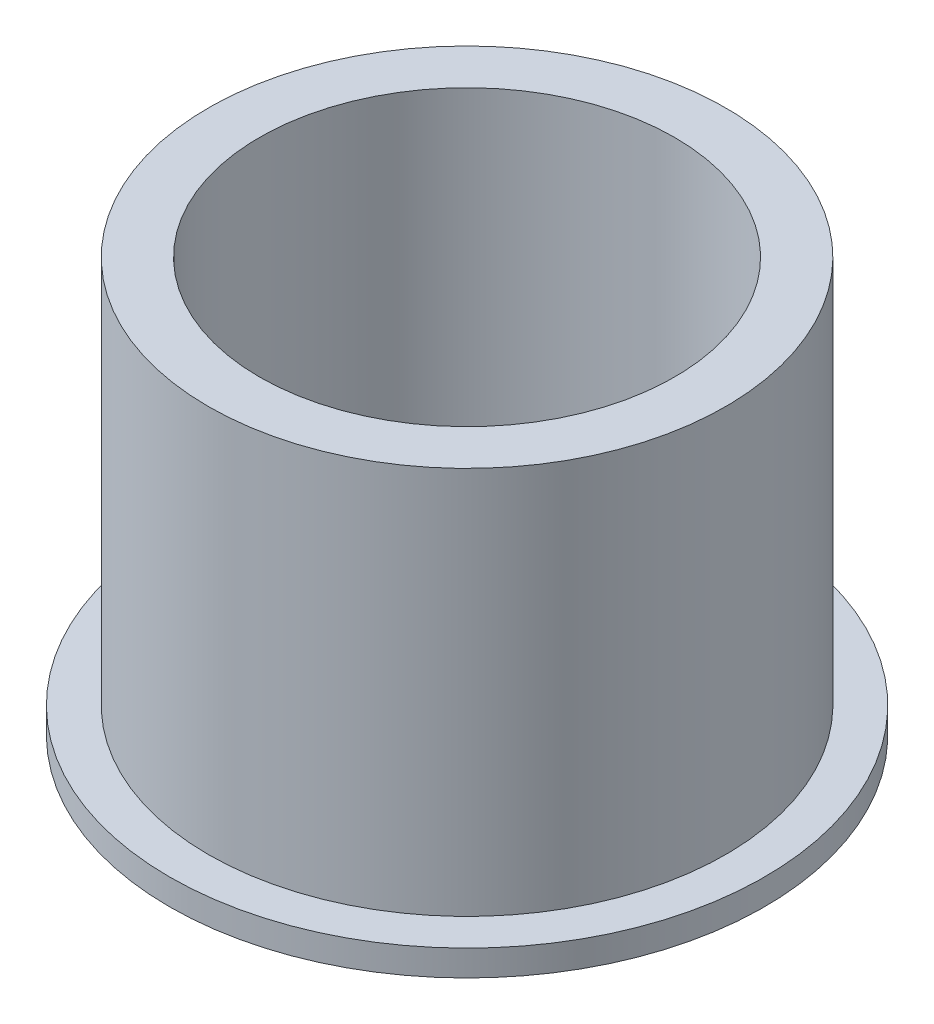
ISO-10303-21;
HEADER;
FILE_DESCRIPTION(('STEP AP214'),'2;1');
FILE_NAME('part.step','',(''),(''),'','','');
FILE_SCHEMA(('AUTOMOTIVE_DESIGN { 1 0 10303 214 1 1 1 1 }'));
ENDSEC;
DATA;
#1=APPLICATION_CONTEXT('core data for automotive mechanical design processes');
#2=APPLICATION_PROTOCOL_DEFINITION('international standard','automotive_design',2000,#1);
#3=PRODUCT_CONTEXT('',#1,'mechanical');
#4=PRODUCT('Part','Part','',(#3));
#5=PRODUCT_RELATED_PRODUCT_CATEGORY('part','',(#4));
#6=PRODUCT_DEFINITION_FORMATION('','',#4);
#7=PRODUCT_DEFINITION_CONTEXT('part definition',#1,'design');
#8=PRODUCT_DEFINITION('design','',#6,#7);
#9=PRODUCT_DEFINITION_SHAPE('','',#8);
#10=(LENGTH_UNIT() NAMED_UNIT(*) SI_UNIT(.MILLI.,.METRE.));
#11=(NAMED_UNIT(*) PLANE_ANGLE_UNIT() SI_UNIT($,.RADIAN.));
#12=(NAMED_UNIT(*) SI_UNIT($,.STERADIAN.) SOLID_ANGLE_UNIT());
#13=UNCERTAINTY_MEASURE_WITH_UNIT(LENGTH_MEASURE(1.E-05),#10,'distance_accuracy_value','');
#14=(GEOMETRIC_REPRESENTATION_CONTEXT(3) GLOBAL_UNCERTAINTY_ASSIGNED_CONTEXT((#13)) GLOBAL_UNIT_ASSIGNED_CONTEXT((#10,
#11,#12)) REPRESENTATION_CONTEXT('',''));
#15=CARTESIAN_POINT('',(0.,0.,0.));
#16=DIRECTION('',(0.,0.,1.));
#17=DIRECTION('',(1.,0.,0.));
#18=AXIS2_PLACEMENT_3D('',#15,#16,#17);
#19=CARTESIAN_POINT('',(0.,25.4,0.));
#20=DIRECTION('',(0.,1.,0.));
#21=DIRECTION('',(0.,0.,1.));
#22=AXIS2_PLACEMENT_3D('',#19,#20,#21);
#23=PLANE('',#22);
#24=CARTESIAN_POINT('',(0.,25.4,0.));
#25=DIRECTION('',(0.,1.,0.));
#26=DIRECTION('',(0.,0.,1.));
#27=AXIS2_PLACEMENT_3D('',#24,#25,#26);
#28=CIRCLE('',#27,15.875);
#29=CARTESIAN_POINT('',(0.,25.4,15.875));
#30=VERTEX_POINT('',#29);
#31=EDGE_CURVE('E10',#30,#30,#28,.T.);
#32=ORIENTED_EDGE('',*,*,#31,.T.);
#33=EDGE_LOOP('',(#32));
#34=FACE_BOUND('',#33,.T.);
#35=CARTESIAN_POINT('',(0.,25.4,0.));
#36=DIRECTION('',(0.,1.,0.));
#37=DIRECTION('',(0.,0.,1.));
#38=AXIS2_PLACEMENT_3D('',#35,#36,#37);
#39=CIRCLE('',#38,12.7381);
#40=CARTESIAN_POINT('',(0.,25.4,12.7381));
#41=VERTEX_POINT('',#40);
#42=EDGE_CURVE('E39',#41,#41,#39,.T.);
#43=ORIENTED_EDGE('',*,*,#42,.F.);
#44=EDGE_LOOP('',(#43));
#45=FACE_BOUND('',#44,.T.);
#46=ADVANCED_FACE('F32',(#34,#45),#23,.T.);
#47=CARTESIAN_POINT('',(0.,0.,0.));
#48=DIRECTION('',(0.,1.,0.));
#49=DIRECTION('',(0.,0.,1.));
#50=AXIS2_PLACEMENT_3D('',#47,#48,#49);
#51=PLANE('',#50);
#52=CARTESIAN_POINT('',(0.,0.,0.));
#53=DIRECTION('',(0.,1.,0.));
#54=DIRECTION('',(0.,0.,1.));
#55=AXIS2_PLACEMENT_3D('',#52,#53,#54);
#56=CIRCLE('',#55,12.7381);
#57=CARTESIAN_POINT('',(0.,0.,12.7381));
#58=VERTEX_POINT('',#57);
#59=EDGE_CURVE('E43',#58,#58,#56,.T.);
#60=ORIENTED_EDGE('',*,*,#59,.T.);
#61=EDGE_LOOP('',(#60));
#62=FACE_BOUND('',#61,.T.);
#63=CARTESIAN_POINT('',(0.,0.,0.));
#64=DIRECTION('',(0.,1.,0.));
#65=DIRECTION('',(0.,0.,1.));
#66=AXIS2_PLACEMENT_3D('',#63,#64,#65);
#67=CIRCLE('',#66,18.25625);
#68=CARTESIAN_POINT('',(0.,0.,18.25625));
#69=VERTEX_POINT('',#68);
#70=EDGE_CURVE('E50',#69,#69,#67,.T.);
#71=ORIENTED_EDGE('',*,*,#70,.F.);
#72=EDGE_LOOP('',(#71));
#73=FACE_BOUND('',#72,.T.);
#74=ADVANCED_FACE('F75',(#62,#73),#51,.F.);
#75=CARTESIAN_POINT('',(0.,25.4,0.));
#76=DIRECTION('',(0.,-1.,0.));
#77=DIRECTION('',(0.,0.,-1.));
#78=AXIS2_PLACEMENT_3D('',#75,#76,#77);
#79=CYLINDRICAL_SURFACE('',#78,15.875);
#80=CARTESIAN_POINT('',(0.,1.5875,0.));
#81=DIRECTION('',(0.,1.,0.));
#82=DIRECTION('',(0.,0.,1.));
#83=AXIS2_PLACEMENT_3D('',#80,#81,#82);
#84=CIRCLE('',#83,15.875);
#85=CARTESIAN_POINT('',(0.,1.5875,15.875));
#86=VERTEX_POINT('',#85);
#87=EDGE_CURVE('E53',#86,#86,#84,.T.);
#88=ORIENTED_EDGE('',*,*,#87,.T.);
#89=EDGE_LOOP('',(#88));
#90=FACE_BOUND('',#89,.T.);
#91=ORIENTED_EDGE('',*,*,#31,.F.);
#92=EDGE_LOOP('',(#91));
#93=FACE_BOUND('',#92,.T.);
#94=ADVANCED_FACE('F34',(#90,#93),#79,.T.);
#95=CARTESIAN_POINT('',(0.,25.4,0.));
#96=DIRECTION('',(0.,-1.,0.));
#97=DIRECTION('',(0.,0.,-1.));
#98=AXIS2_PLACEMENT_3D('',#95,#96,#97);
#99=CYLINDRICAL_SURFACE('',#98,12.7381);
#100=ORIENTED_EDGE('',*,*,#42,.T.);
#101=EDGE_LOOP('',(#100));
#102=FACE_BOUND('',#101,.T.);
#103=ORIENTED_EDGE('',*,*,#59,.F.);
#104=EDGE_LOOP('',(#103));
#105=FACE_BOUND('',#104,.T.);
#106=ADVANCED_FACE('F64',(#102,#105),#99,.F.);
#107=CARTESIAN_POINT('',(0.,1.5875,0.));
#108=DIRECTION('',(0.,1.,0.));
#109=DIRECTION('',(0.,0.,1.));
#110=AXIS2_PLACEMENT_3D('',#107,#108,#109);
#111=PLANE('',#110);
#112=CARTESIAN_POINT('',(0.,1.5875,0.));
#113=DIRECTION('',(0.,1.,0.));
#114=DIRECTION('',(0.,0.,1.));
#115=AXIS2_PLACEMENT_3D('',#112,#113,#114);
#116=CIRCLE('',#115,18.25625);
#117=CARTESIAN_POINT('',(0.,1.5875,18.25625));
#118=VERTEX_POINT('',#117);
#119=EDGE_CURVE('E48',#118,#118,#116,.T.);
#120=ORIENTED_EDGE('',*,*,#119,.T.);
#121=EDGE_LOOP('',(#120));
#122=FACE_BOUND('',#121,.T.);
#123=ORIENTED_EDGE('',*,*,#87,.F.);
#124=EDGE_LOOP('',(#123));
#125=FACE_BOUND('',#124,.T.);
#126=ADVANCED_FACE('F61',(#122,#125),#111,.T.);
#127=CARTESIAN_POINT('',(0.,1.5875,0.));
#128=DIRECTION('',(0.,-1.,0.));
#129=DIRECTION('',(0.,0.,-1.));
#130=AXIS2_PLACEMENT_3D('',#127,#128,#129);
#131=CYLINDRICAL_SURFACE('',#130,18.25625);
#132=ORIENTED_EDGE('',*,*,#119,.F.);
#133=EDGE_LOOP('',(#132));
#134=FACE_BOUND('',#133,.T.);
#135=ORIENTED_EDGE('',*,*,#70,.T.);
#136=EDGE_LOOP('',(#135));
#137=FACE_BOUND('',#136,.T.);
#138=ADVANCED_FACE('F63',(#134,#137),#131,.T.);
#139=CLOSED_SHELL('',(#46,#74,#94,#106,#126,#138));
#140=MANIFOLD_SOLID_BREP('B2',#139);
#141=ADVANCED_BREP_SHAPE_REPRESENTATION('',(#18,#140),#14);
#142=SHAPE_DEFINITION_REPRESENTATION(#9,#141);
ENDSEC;
END-ISO-10303-21;
